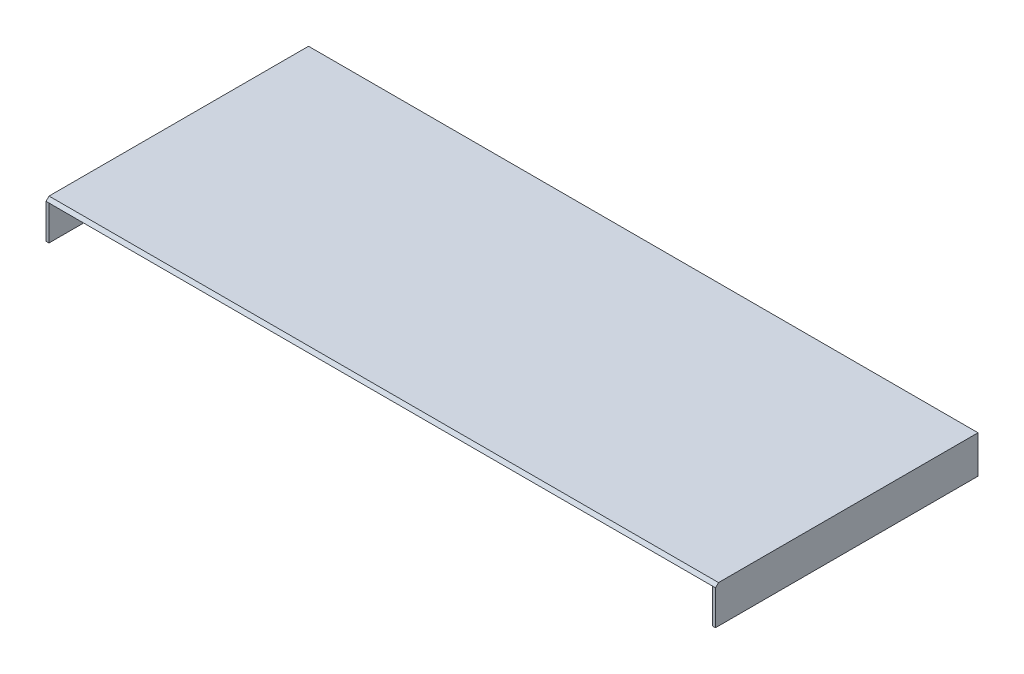
ISO-10303-21;
HEADER;
FILE_DESCRIPTION(('STEP AP214'),'2;1');
FILE_NAME('part.step','',(''),(''),'','','');
FILE_SCHEMA(('AUTOMOTIVE_DESIGN { 1 0 10303 214 1 1 1 1 }'));
ENDSEC;
DATA;
#1=APPLICATION_CONTEXT('core data for automotive mechanical design processes');
#2=APPLICATION_PROTOCOL_DEFINITION('international standard','automotive_design',2000,#1);
#3=PRODUCT_CONTEXT('',#1,'mechanical');
#4=PRODUCT('Part','Part','',(#3));
#5=PRODUCT_RELATED_PRODUCT_CATEGORY('part','',(#4));
#6=PRODUCT_DEFINITION_FORMATION('','',#4);
#7=PRODUCT_DEFINITION_CONTEXT('part definition',#1,'design');
#8=PRODUCT_DEFINITION('design','',#6,#7);
#9=PRODUCT_DEFINITION_SHAPE('','',#8);
#10=(LENGTH_UNIT() NAMED_UNIT(*) SI_UNIT(.MILLI.,.METRE.));
#11=(NAMED_UNIT(*) PLANE_ANGLE_UNIT() SI_UNIT($,.RADIAN.));
#12=(NAMED_UNIT(*) SI_UNIT($,.STERADIAN.) SOLID_ANGLE_UNIT());
#13=UNCERTAINTY_MEASURE_WITH_UNIT(LENGTH_MEASURE(1.E-05),#10,'distance_accuracy_value','');
#14=(GEOMETRIC_REPRESENTATION_CONTEXT(3) GLOBAL_UNCERTAINTY_ASSIGNED_CONTEXT((#13)) GLOBAL_UNIT_ASSIGNED_CONTEXT((#10,
#11,#12)) REPRESENTATION_CONTEXT('',''));
#15=CARTESIAN_POINT('',(0.,0.,0.));
#16=DIRECTION('',(0.,0.,1.));
#17=DIRECTION('',(1.,0.,0.));
#18=AXIS2_PLACEMENT_3D('',#15,#16,#17);
#19=CARTESIAN_POINT('',(193.5,-1.75000000000002,151.75));
#20=DIRECTION('',(0.,1.,0.));
#21=DIRECTION('',(0.,0.,1.));
#22=AXIS2_PLACEMENT_3D('',#19,#20,#21);
#23=PLANE('',#22);
#24=DIRECTION('',(0.,0.,1.));
#25=VECTOR('',#24,1.);
#26=CARTESIAN_POINT('',(-191.75,-1.75000000000002,1.74999999999995));
#27=LINE('',#26,#25);
#28=CARTESIAN_POINT('',(-191.75,-1.75000000000002,1.74999999999995));
#29=VERTEX_POINT('',#28);
#30=CARTESIAN_POINT('',(-191.75,-1.75000000000002,151.75));
#31=VERTEX_POINT('',#30);
#32=EDGE_CURVE('E49',#29,#31,#27,.T.);
#33=ORIENTED_EDGE('',*,*,#32,.F.);
#34=DIRECTION('',(-1.,0.,0.));
#35=VECTOR('',#34,1.);
#36=CARTESIAN_POINT('',(191.75,-1.75000000000002,1.75));
#37=LINE('',#36,#35);
#38=CARTESIAN_POINT('',(191.75,-1.75000000000002,1.75));
#39=VERTEX_POINT('',#38);
#40=EDGE_CURVE('E177',#39,#29,#37,.T.);
#41=ORIENTED_EDGE('',*,*,#40,.F.);
#42=DIRECTION('',(0.,0.,-1.));
#43=VECTOR('',#42,1.);
#44=CARTESIAN_POINT('',(191.75,-1.75000000000002,151.75));
#45=LINE('',#44,#43);
#46=CARTESIAN_POINT('',(191.75,-1.75000000000002,151.75));
#47=VERTEX_POINT('',#46);
#48=EDGE_CURVE('E174',#47,#39,#45,.T.);
#49=ORIENTED_EDGE('',*,*,#48,.F.);
#50=DIRECTION('',(-1.,0.,0.));
#51=VECTOR('',#50,1.);
#52=CARTESIAN_POINT('',(193.5,-1.75000000000002,151.75));
#53=LINE('',#52,#51);
#54=EDGE_CURVE('E145',#47,#31,#53,.T.);
#55=ORIENTED_EDGE('',*,*,#54,.T.);
#56=EDGE_LOOP('',(#33,#41,#49,#55));
#57=FACE_BOUND('',#56,.T.);
#58=ADVANCED_FACE('F34',(#57),#23,.F.);
#59=CARTESIAN_POINT('',(193.5,-1.75000000000002,0.));
#60=DIRECTION('',(0.,0.,1.));
#61=DIRECTION('',(1.,0.,0.));
#62=AXIS2_PLACEMENT_3D('',#59,#60,#61);
#63=PLANE('',#62);
#64=DIRECTION('',(0.,1.,0.));
#65=VECTOR('',#64,1.);
#66=CARTESIAN_POINT('',(-193.5,-1.75000000000002,0.));
#67=LINE('',#66,#65);
#68=CARTESIAN_POINT('',(-193.5,-21.75,0.));
#69=VERTEX_POINT('',#68);
#70=CARTESIAN_POINT('',(-193.5,0.,0.));
#71=VERTEX_POINT('',#70);
#72=EDGE_CURVE('E113',#69,#71,#67,.T.);
#73=ORIENTED_EDGE('',*,*,#72,.T.);
#74=DIRECTION('',(-1.,0.,0.));
#75=VECTOR('',#74,1.);
#76=CARTESIAN_POINT('',(193.5,0.,0.));
#77=LINE('',#76,#75);
#78=CARTESIAN_POINT('',(193.5,0.,0.));
#79=VERTEX_POINT('',#78);
#80=EDGE_CURVE('E11',#79,#71,#77,.T.);
#81=ORIENTED_EDGE('',*,*,#80,.F.);
#82=DIRECTION('',(0.,1.,0.));
#83=VECTOR('',#82,1.);
#84=CARTESIAN_POINT('',(193.5,-1.75000000000002,0.));
#85=LINE('',#84,#83);
#86=CARTESIAN_POINT('',(193.5,-21.75,0.));
#87=VERTEX_POINT('',#86);
#88=EDGE_CURVE('E138',#87,#79,#85,.T.);
#89=ORIENTED_EDGE('',*,*,#88,.F.);
#90=DIRECTION('',(1.,0.,0.));
#91=VECTOR('',#90,1.);
#92=CARTESIAN_POINT('',(-193.5,-21.75,0.));
#93=LINE('',#92,#91);
#94=EDGE_CURVE('E117',#69,#87,#93,.T.);
#95=ORIENTED_EDGE('',*,*,#94,.F.);
#96=EDGE_LOOP('',(#73,#81,#89,#95));
#97=FACE_BOUND('',#96,.T.);
#98=ADVANCED_FACE('F36',(#97),#63,.F.);
#99=CARTESIAN_POINT('',(193.5,0.,0.));
#100=DIRECTION('',(0.,-1.,0.));
#101=DIRECTION('',(0.,0.,-1.));
#102=AXIS2_PLACEMENT_3D('',#99,#100,#101);
#103=PLANE('',#102);
#104=DIRECTION('',(0.,0.,1.));
#105=VECTOR('',#104,1.);
#106=CARTESIAN_POINT('',(-193.5,0.,0.));
#107=LINE('',#106,#105);
#108=CARTESIAN_POINT('',(-193.5,0.,150.));
#109=VERTEX_POINT('',#108);
#110=EDGE_CURVE('E131',#71,#109,#107,.T.);
#111=ORIENTED_EDGE('',*,*,#110,.T.);
#112=DIRECTION('',(-1.,0.,0.));
#113=VECTOR('',#112,1.);
#114=CARTESIAN_POINT('',(193.5,0.,150.));
#115=LINE('',#114,#113);
#116=CARTESIAN_POINT('',(193.5,0.,150.));
#117=VERTEX_POINT('',#116);
#118=EDGE_CURVE('E42',#117,#109,#115,.T.);
#119=ORIENTED_EDGE('',*,*,#118,.F.);
#120=DIRECTION('',(0.,0.,1.));
#121=VECTOR('',#120,1.);
#122=CARTESIAN_POINT('',(193.5,0.,0.));
#123=LINE('',#122,#121);
#124=EDGE_CURVE('E141',#79,#117,#123,.T.);
#125=ORIENTED_EDGE('',*,*,#124,.F.);
#126=ORIENTED_EDGE('',*,*,#80,.T.);
#127=EDGE_LOOP('',(#111,#119,#125,#126));
#128=FACE_BOUND('',#127,.T.);
#129=ADVANCED_FACE('F158',(#128),#103,.F.);
#130=CARTESIAN_POINT('',(193.5,-1.75000000000002,151.75));
#131=DIRECTION('',(0.,-0.707106781186498,-0.707106781186598));
#132=DIRECTION('',(0.,0.707106781186598,-0.707106781186497));
#133=AXIS2_PLACEMENT_3D('',#130,#131,#132);
#134=PLANE('',#133);
#135=DIRECTION('',(0.,-0.707106781186598,0.707106781186497));
#136=VECTOR('',#135,1.);
#137=CARTESIAN_POINT('',(-193.5,-1.75000000000002,151.75));
#138=LINE('',#137,#136);
#139=CARTESIAN_POINT('',(-193.5,-1.75000000000002,151.75));
#140=VERTEX_POINT('',#139);
#141=EDGE_CURVE('E142',#109,#140,#138,.T.);
#142=ORIENTED_EDGE('',*,*,#141,.T.);
#143=DIRECTION('',(-1.,0.,0.));
#144=VECTOR('',#143,1.);
#145=CARTESIAN_POINT('',(-191.75,-1.75000000000002,151.75));
#146=LINE('',#145,#144);
#147=EDGE_CURVE('E57',#31,#140,#146,.T.);
#148=ORIENTED_EDGE('',*,*,#147,.F.);
#149=ORIENTED_EDGE('',*,*,#54,.F.);
#150=CARTESIAN_POINT('',(193.5,-1.75000000000002,151.75));
#151=VERTEX_POINT('',#150);
#152=EDGE_CURVE('E149',#151,#47,#53,.T.);
#153=ORIENTED_EDGE('',*,*,#152,.F.);
#154=DIRECTION('',(0.,-0.707106781186598,0.707106781186497));
#155=VECTOR('',#154,1.);
#156=CARTESIAN_POINT('',(193.5,-1.75000000000002,151.75));
#157=LINE('',#156,#155);
#158=EDGE_CURVE('E144',#117,#151,#157,.T.);
#159=ORIENTED_EDGE('',*,*,#158,.F.);
#160=ORIENTED_EDGE('',*,*,#118,.T.);
#161=EDGE_LOOP('',(#142,#148,#149,#153,#159,#160));
#162=FACE_BOUND('',#161,.T.);
#163=ADVANCED_FACE('F154',(#162),#134,.F.);
#164=CARTESIAN_POINT('',(193.5,0.,0.));
#165=DIRECTION('',(1.,0.,0.));
#166=DIRECTION('',(0.,0.,-1.));
#167=AXIS2_PLACEMENT_3D('',#164,#165,#166);
#168=PLANE('',#167);
#169=ORIENTED_EDGE('',*,*,#88,.T.);
#170=ORIENTED_EDGE('',*,*,#124,.T.);
#171=ORIENTED_EDGE('',*,*,#158,.T.);
#172=DIRECTION('',(0.,1.,0.));
#173=VECTOR('',#172,1.);
#174=CARTESIAN_POINT('',(193.5,-21.75,151.75));
#175=LINE('',#174,#173);
#176=CARTESIAN_POINT('',(193.5,-21.75,151.75));
#177=VERTEX_POINT('',#176);
#178=EDGE_CURVE('E129',#177,#151,#175,.T.);
#179=ORIENTED_EDGE('',*,*,#178,.F.);
#180=DIRECTION('',(0.,0.,1.));
#181=VECTOR('',#180,1.);
#182=CARTESIAN_POINT('',(193.5,-21.75,0.));
#183=LINE('',#182,#181);
#184=EDGE_CURVE('E161',#87,#177,#183,.T.);
#185=ORIENTED_EDGE('',*,*,#184,.F.);
#186=EDGE_LOOP('',(#169,#170,#171,#179,#185));
#187=FACE_BOUND('',#186,.T.);
#188=ADVANCED_FACE('F203',(#187),#168,.T.);
#189=CARTESIAN_POINT('',(-193.5,0.,0.));
#190=DIRECTION('',(1.,0.,0.));
#191=DIRECTION('',(0.,0.,-1.));
#192=AXIS2_PLACEMENT_3D('',#189,#190,#191);
#193=PLANE('',#192);
#194=ORIENTED_EDGE('',*,*,#72,.F.);
#195=DIRECTION('',(0.,0.,-1.));
#196=VECTOR('',#195,1.);
#197=CARTESIAN_POINT('',(-193.5,-21.75,151.75));
#198=LINE('',#197,#196);
#199=CARTESIAN_POINT('',(-193.5,-21.75,151.75));
#200=VERTEX_POINT('',#199);
#201=EDGE_CURVE('E106',#200,#69,#198,.T.);
#202=ORIENTED_EDGE('',*,*,#201,.F.);
#203=DIRECTION('',(0.,1.,0.));
#204=VECTOR('',#203,1.);
#205=CARTESIAN_POINT('',(-193.5,-21.75,151.75));
#206=LINE('',#205,#204);
#207=EDGE_CURVE('E111',#200,#140,#206,.T.);
#208=ORIENTED_EDGE('',*,*,#207,.T.);
#209=ORIENTED_EDGE('',*,*,#141,.F.);
#210=ORIENTED_EDGE('',*,*,#110,.F.);
#211=EDGE_LOOP('',(#194,#202,#208,#209,#210));
#212=FACE_BOUND('',#211,.T.);
#213=ADVANCED_FACE('F108',(#212),#193,.F.);
#214=CARTESIAN_POINT('',(-191.75,-21.75,151.75));
#215=DIRECTION('',(0.,0.,-1.));
#216=DIRECTION('',(-1.,0.,0.));
#217=AXIS2_PLACEMENT_3D('',#214,#215,#216);
#218=PLANE('',#217);
#219=ORIENTED_EDGE('',*,*,#147,.T.);
#220=ORIENTED_EDGE('',*,*,#207,.F.);
#221=DIRECTION('',(-1.,0.,0.));
#222=VECTOR('',#221,1.);
#223=CARTESIAN_POINT('',(-191.75,-21.75,151.75));
#224=LINE('',#223,#222);
#225=CARTESIAN_POINT('',(-191.75,-21.75,151.75));
#226=VERTEX_POINT('',#225);
#227=EDGE_CURVE('E118',#226,#200,#224,.T.);
#228=ORIENTED_EDGE('',*,*,#227,.F.);
#229=DIRECTION('',(0.,1.,0.));
#230=VECTOR('',#229,1.);
#231=CARTESIAN_POINT('',(-191.75,-21.75,151.75));
#232=LINE('',#231,#230);
#233=EDGE_CURVE('E172',#226,#31,#232,.T.);
#234=ORIENTED_EDGE('',*,*,#233,.T.);
#235=EDGE_LOOP('',(#219,#220,#228,#234));
#236=FACE_BOUND('',#235,.T.);
#237=ADVANCED_FACE('F128',(#236),#218,.F.);
#238=CARTESIAN_POINT('',(193.5,-21.75,151.75));
#239=DIRECTION('',(0.,0.,-1.));
#240=DIRECTION('',(-1.,0.,0.));
#241=AXIS2_PLACEMENT_3D('',#238,#239,#240);
#242=PLANE('',#241);
#243=ORIENTED_EDGE('',*,*,#152,.T.);
#244=DIRECTION('',(0.,1.,0.));
#245=VECTOR('',#244,1.);
#246=CARTESIAN_POINT('',(191.75,-21.75,151.75));
#247=LINE('',#246,#245);
#248=CARTESIAN_POINT('',(191.75,-21.75,151.75));
#249=VERTEX_POINT('',#248);
#250=EDGE_CURVE('E134',#249,#47,#247,.T.);
#251=ORIENTED_EDGE('',*,*,#250,.F.);
#252=DIRECTION('',(-1.,0.,0.));
#253=VECTOR('',#252,1.);
#254=CARTESIAN_POINT('',(193.5,-21.75,151.75));
#255=LINE('',#254,#253);
#256=EDGE_CURVE('E163',#177,#249,#255,.T.);
#257=ORIENTED_EDGE('',*,*,#256,.F.);
#258=ORIENTED_EDGE('',*,*,#178,.T.);
#259=EDGE_LOOP('',(#243,#251,#257,#258));
#260=FACE_BOUND('',#259,.T.);
#261=ADVANCED_FACE('F194',(#260),#242,.F.);
#262=CARTESIAN_POINT('',(191.75,-21.75,151.75));
#263=DIRECTION('',(1.,0.,0.));
#264=DIRECTION('',(0.,0.,-1.));
#265=AXIS2_PLACEMENT_3D('',#262,#263,#264);
#266=PLANE('',#265);
#267=ORIENTED_EDGE('',*,*,#48,.T.);
#268=DIRECTION('',(0.,1.,0.));
#269=VECTOR('',#268,1.);
#270=CARTESIAN_POINT('',(191.75,-21.75,1.75));
#271=LINE('',#270,#269);
#272=CARTESIAN_POINT('',(191.75,-21.75,1.75));
#273=VERTEX_POINT('',#272);
#274=EDGE_CURVE('E184',#273,#39,#271,.T.);
#275=ORIENTED_EDGE('',*,*,#274,.F.);
#276=DIRECTION('',(0.,0.,-1.));
#277=VECTOR('',#276,1.);
#278=CARTESIAN_POINT('',(191.75,-21.75,151.75));
#279=LINE('',#278,#277);
#280=EDGE_CURVE('E167',#249,#273,#279,.T.);
#281=ORIENTED_EDGE('',*,*,#280,.F.);
#282=ORIENTED_EDGE('',*,*,#250,.T.);
#283=EDGE_LOOP('',(#267,#275,#281,#282));
#284=FACE_BOUND('',#283,.T.);
#285=ADVANCED_FACE('F190',(#284),#266,.F.);
#286=CARTESIAN_POINT('',(191.75,-21.75,1.75));
#287=DIRECTION('',(0.,0.,-1.));
#288=DIRECTION('',(-1.,0.,0.));
#289=AXIS2_PLACEMENT_3D('',#286,#287,#288);
#290=PLANE('',#289);
#291=ORIENTED_EDGE('',*,*,#40,.T.);
#292=DIRECTION('',(0.,1.,0.));
#293=VECTOR('',#292,1.);
#294=CARTESIAN_POINT('',(-191.75,-21.75,1.74999999999995));
#295=LINE('',#294,#293);
#296=CARTESIAN_POINT('',(-191.75,-21.75,1.74999999999995));
#297=VERTEX_POINT('',#296);
#298=EDGE_CURVE('E181',#297,#29,#295,.T.);
#299=ORIENTED_EDGE('',*,*,#298,.F.);
#300=DIRECTION('',(-1.,0.,0.));
#301=VECTOR('',#300,1.);
#302=CARTESIAN_POINT('',(191.75,-21.75,1.75));
#303=LINE('',#302,#301);
#304=EDGE_CURVE('E169',#273,#297,#303,.T.);
#305=ORIENTED_EDGE('',*,*,#304,.F.);
#306=ORIENTED_EDGE('',*,*,#274,.T.);
#307=EDGE_LOOP('',(#291,#299,#305,#306));
#308=FACE_BOUND('',#307,.T.);
#309=ADVANCED_FACE('F201',(#308),#290,.F.);
#310=CARTESIAN_POINT('',(-191.75,-21.75,1.74999999999995));
#311=DIRECTION('',(-1.,0.,0.));
#312=DIRECTION('',(0.,0.,1.));
#313=AXIS2_PLACEMENT_3D('',#310,#311,#312);
#314=PLANE('',#313);
#315=ORIENTED_EDGE('',*,*,#32,.T.);
#316=ORIENTED_EDGE('',*,*,#233,.F.);
#317=DIRECTION('',(0.,0.,1.));
#318=VECTOR('',#317,1.);
#319=CARTESIAN_POINT('',(-191.75,-21.75,1.74999999999995));
#320=LINE('',#319,#318);
#321=EDGE_CURVE('E123',#297,#226,#320,.T.);
#322=ORIENTED_EDGE('',*,*,#321,.F.);
#323=ORIENTED_EDGE('',*,*,#298,.T.);
#324=EDGE_LOOP('',(#315,#316,#322,#323));
#325=FACE_BOUND('',#324,.T.);
#326=ADVANCED_FACE('F197',(#325),#314,.F.);
#327=CARTESIAN_POINT('',(0.,-21.75,0.));
#328=DIRECTION('',(0.,-1.,0.));
#329=DIRECTION('',(0.,0.,-1.));
#330=AXIS2_PLACEMENT_3D('',#327,#328,#329);
#331=PLANE('',#330);
#332=ORIENTED_EDGE('',*,*,#227,.T.);
#333=ORIENTED_EDGE('',*,*,#201,.T.);
#334=ORIENTED_EDGE('',*,*,#94,.T.);
#335=ORIENTED_EDGE('',*,*,#184,.T.);
#336=ORIENTED_EDGE('',*,*,#256,.T.);
#337=ORIENTED_EDGE('',*,*,#280,.T.);
#338=ORIENTED_EDGE('',*,*,#304,.T.);
#339=ORIENTED_EDGE('',*,*,#321,.T.);
#340=EDGE_LOOP('',(#332,#333,#334,#335,#336,#337,#338,#339));
#341=FACE_BOUND('',#340,.T.);
#342=ADVANCED_FACE('F121',(#341),#331,.T.);
#343=CLOSED_SHELL('',(#58,#98,#129,#163,#188,#213,#237,#261,#285,#309,#326,#342));
#344=MANIFOLD_SOLID_BREP('B2',#343);
#345=ADVANCED_BREP_SHAPE_REPRESENTATION('',(#18,#344),#14);
#346=SHAPE_DEFINITION_REPRESENTATION(#9,#345);
ENDSEC;
END-ISO-10303-21;
